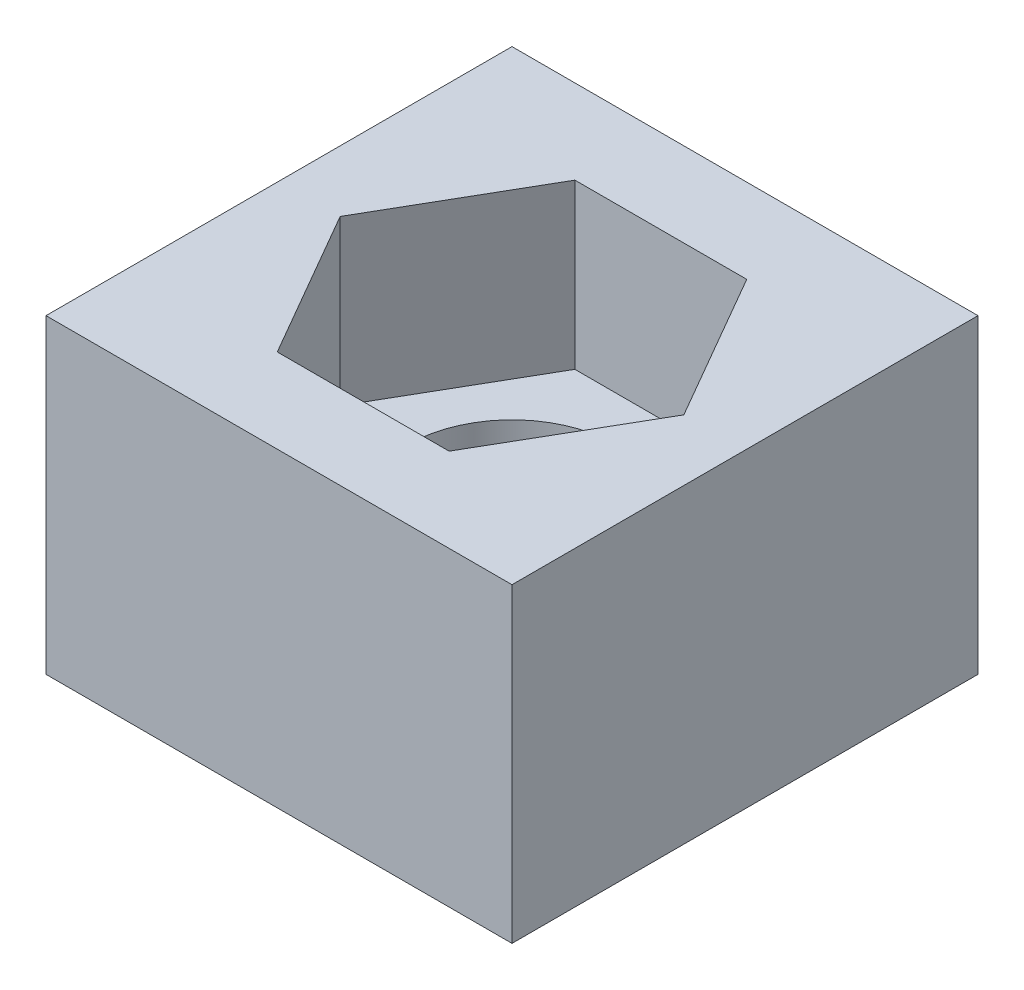
ISO-10303-21;
HEADER;
FILE_DESCRIPTION(('STEP AP214'),'2;1');
FILE_NAME('part.step','',(''),(''),'','','');
FILE_SCHEMA(('AUTOMOTIVE_DESIGN { 1 0 10303 214 1 1 1 1 }'));
ENDSEC;
DATA;
#1=APPLICATION_CONTEXT('core data for automotive mechanical design processes');
#2=APPLICATION_PROTOCOL_DEFINITION('international standard','automotive_design',2000,#1);
#3=PRODUCT_CONTEXT('',#1,'mechanical');
#4=PRODUCT('Part','Part','',(#3));
#5=PRODUCT_RELATED_PRODUCT_CATEGORY('part','',(#4));
#6=PRODUCT_DEFINITION_FORMATION('','',#4);
#7=PRODUCT_DEFINITION_CONTEXT('part definition',#1,'design');
#8=PRODUCT_DEFINITION('design','',#6,#7);
#9=PRODUCT_DEFINITION_SHAPE('','',#8);
#10=(LENGTH_UNIT() NAMED_UNIT(*) SI_UNIT(.MILLI.,.METRE.));
#11=(NAMED_UNIT(*) PLANE_ANGLE_UNIT() SI_UNIT($,.RADIAN.));
#12=(NAMED_UNIT(*) SI_UNIT($,.STERADIAN.) SOLID_ANGLE_UNIT());
#13=UNCERTAINTY_MEASURE_WITH_UNIT(LENGTH_MEASURE(1.E-05),#10,'distance_accuracy_value','');
#14=(GEOMETRIC_REPRESENTATION_CONTEXT(3) GLOBAL_UNCERTAINTY_ASSIGNED_CONTEXT((#13)) GLOBAL_UNIT_ASSIGNED_CONTEXT((#10,
#11,#12)) REPRESENTATION_CONTEXT('',''));
#15=CARTESIAN_POINT('',(0.,0.,0.));
#16=DIRECTION('',(0.,0.,1.));
#17=DIRECTION('',(1.,0.,0.));
#18=AXIS2_PLACEMENT_3D('',#15,#16,#17);
#19=CARTESIAN_POINT('',(0.,25.4,0.));
#20=DIRECTION('',(1.,0.,0.));
#21=DIRECTION('',(0.,0.,-1.));
#22=AXIS2_PLACEMENT_3D('',#19,#20,#21);
#23=PLANE('',#22);
#24=DIRECTION('',(0.,0.,1.));
#25=VECTOR('',#24,1.);
#26=CARTESIAN_POINT('',(0.,0.,0.));
#27=LINE('',#26,#25);
#28=CARTESIAN_POINT('',(0.,0.,-38.1018276824676));
#29=VERTEX_POINT('',#28);
#30=CARTESIAN_POINT('',(0.,0.,0.));
#31=VERTEX_POINT('',#30);
#32=EDGE_CURVE('E195',#29,#31,#27,.T.);
#33=ORIENTED_EDGE('',*,*,#32,.T.);
#34=DIRECTION('',(0.,-1.,0.));
#35=VECTOR('',#34,1.);
#36=CARTESIAN_POINT('',(0.,25.4,0.));
#37=LINE('',#36,#35);
#38=CARTESIAN_POINT('',(0.,25.4,0.));
#39=VERTEX_POINT('',#38);
#40=EDGE_CURVE('E11',#39,#31,#37,.T.);
#41=ORIENTED_EDGE('',*,*,#40,.F.);
#42=DIRECTION('',(0.,0.,1.));
#43=VECTOR('',#42,1.);
#44=CARTESIAN_POINT('',(0.,25.4,0.));
#45=LINE('',#44,#43);
#46=CARTESIAN_POINT('',(0.,25.4,-38.1018276824676));
#47=VERTEX_POINT('',#46);
#48=EDGE_CURVE('E207',#47,#39,#45,.T.);
#49=ORIENTED_EDGE('',*,*,#48,.F.);
#50=DIRECTION('',(0.,-1.,0.));
#51=VECTOR('',#50,1.);
#52=CARTESIAN_POINT('',(0.,25.4,-38.1018276824676));
#53=LINE('',#52,#51);
#54=EDGE_CURVE('E217',#47,#29,#53,.T.);
#55=ORIENTED_EDGE('',*,*,#54,.T.);
#56=EDGE_LOOP('',(#33,#41,#49,#55));
#57=FACE_BOUND('',#56,.T.);
#58=ADVANCED_FACE('F45',(#57),#23,.F.);
#59=CARTESIAN_POINT('',(0.,25.4,0.));
#60=DIRECTION('',(0.,0.,-1.));
#61=DIRECTION('',(-1.,0.,0.));
#62=AXIS2_PLACEMENT_3D('',#59,#60,#61);
#63=PLANE('',#62);
#64=DIRECTION('',(1.,0.,0.));
#65=VECTOR('',#64,1.);
#66=CARTESIAN_POINT('',(0.,0.,0.));
#67=LINE('',#66,#65);
#68=CARTESIAN_POINT('',(38.1018276824676,0.,0.));
#69=VERTEX_POINT('',#68);
#70=EDGE_CURVE('E221',#31,#69,#67,.T.);
#71=ORIENTED_EDGE('',*,*,#70,.T.);
#72=DIRECTION('',(0.,-1.,0.));
#73=VECTOR('',#72,1.);
#74=CARTESIAN_POINT('',(38.1018276824676,25.4,0.));
#75=LINE('',#74,#73);
#76=CARTESIAN_POINT('',(38.1018276824676,25.4,0.));
#77=VERTEX_POINT('',#76);
#78=EDGE_CURVE('E53',#77,#69,#75,.T.);
#79=ORIENTED_EDGE('',*,*,#78,.F.);
#80=DIRECTION('',(1.,0.,0.));
#81=VECTOR('',#80,1.);
#82=CARTESIAN_POINT('',(0.,25.4,0.));
#83=LINE('',#82,#81);
#84=EDGE_CURVE('E97',#39,#77,#83,.T.);
#85=ORIENTED_EDGE('',*,*,#84,.F.);
#86=ORIENTED_EDGE('',*,*,#40,.T.);
#87=EDGE_LOOP('',(#71,#79,#85,#86));
#88=FACE_BOUND('',#87,.T.);
#89=ADVANCED_FACE('F256',(#88),#63,.F.);
#90=CARTESIAN_POINT('',(38.1018276824676,25.4,0.));
#91=DIRECTION('',(-1.,0.,0.));
#92=DIRECTION('',(0.,0.,1.));
#93=AXIS2_PLACEMENT_3D('',#90,#91,#92);
#94=PLANE('',#93);
#95=DIRECTION('',(0.,0.,-1.));
#96=VECTOR('',#95,1.);
#97=CARTESIAN_POINT('',(38.1018276824676,0.,0.));
#98=LINE('',#97,#96);
#99=CARTESIAN_POINT('',(38.1018276824676,0.,-38.1018276824676));
#100=VERTEX_POINT('',#99);
#101=EDGE_CURVE('E224',#69,#100,#98,.T.);
#102=ORIENTED_EDGE('',*,*,#101,.T.);
#103=DIRECTION('',(0.,-1.,0.));
#104=VECTOR('',#103,1.);
#105=CARTESIAN_POINT('',(38.1018276824676,25.4,-38.1018276824676));
#106=LINE('',#105,#104);
#107=CARTESIAN_POINT('',(38.1018276824676,25.4,-38.1018276824676));
#108=VERTEX_POINT('',#107);
#109=EDGE_CURVE('E231',#108,#100,#106,.T.);
#110=ORIENTED_EDGE('',*,*,#109,.F.);
#111=DIRECTION('',(0.,0.,-1.));
#112=VECTOR('',#111,1.);
#113=CARTESIAN_POINT('',(38.1018276824676,25.4,0.));
#114=LINE('',#113,#112);
#115=EDGE_CURVE('E212',#77,#108,#114,.T.);
#116=ORIENTED_EDGE('',*,*,#115,.F.);
#117=ORIENTED_EDGE('',*,*,#78,.T.);
#118=EDGE_LOOP('',(#102,#110,#116,#117));
#119=FACE_BOUND('',#118,.T.);
#120=ADVANCED_FACE('F238',(#119),#94,.F.);
#121=CARTESIAN_POINT('',(0.,25.4,-38.1018276824676));
#122=DIRECTION('',(0.,0.,1.));
#123=DIRECTION('',(1.,0.,0.));
#124=AXIS2_PLACEMENT_3D('',#121,#122,#123);
#125=PLANE('',#124);
#126=DIRECTION('',(-1.,0.,0.));
#127=VECTOR('',#126,1.);
#128=CARTESIAN_POINT('',(0.,0.,-38.1018276824676));
#129=LINE('',#128,#127);
#130=EDGE_CURVE('E90',#100,#29,#129,.T.);
#131=ORIENTED_EDGE('',*,*,#130,.T.);
#132=ORIENTED_EDGE('',*,*,#54,.F.);
#133=DIRECTION('',(-1.,0.,0.));
#134=VECTOR('',#133,1.);
#135=CARTESIAN_POINT('',(0.,25.4,-38.1018276824676));
#136=LINE('',#135,#134);
#137=EDGE_CURVE('E69',#108,#47,#136,.T.);
#138=ORIENTED_EDGE('',*,*,#137,.F.);
#139=ORIENTED_EDGE('',*,*,#109,.T.);
#140=EDGE_LOOP('',(#131,#132,#138,#139));
#141=FACE_BOUND('',#140,.T.);
#142=ADVANCED_FACE('F246',(#141),#125,.F.);
#143=CARTESIAN_POINT('',(0.,25.4,0.));
#144=DIRECTION('',(0.,-1.,0.));
#145=DIRECTION('',(0.,0.,-1.));
#146=AXIS2_PLACEMENT_3D('',#143,#144,#145);
#147=PLANE('',#146);
#148=DIRECTION('',(-0.500000000000001,0.,-0.866025403784438));
#149=VECTOR('',#148,1.);
#150=CARTESIAN_POINT('',(33.1009128568949,25.4,-19.0509138412338));
#151=LINE('',#150,#149);
#152=CARTESIAN_POINT('',(33.1009128568949,25.4,-19.0509138412338));
#153=VERTEX_POINT('',#152);
#154=CARTESIAN_POINT('',(26.0759133490643,25.4,-31.2185699119426));
#155=VERTEX_POINT('',#154);
#156=EDGE_CURVE('E178',#153,#155,#151,.T.);
#157=ORIENTED_EDGE('',*,*,#156,.F.);
#158=DIRECTION('',(0.499999999999995,0.,-0.866025403784441));
#159=VECTOR('',#158,1.);
#160=CARTESIAN_POINT('',(26.0759133490645,25.4,-6.88325777052505));
#161=LINE('',#160,#159);
#162=CARTESIAN_POINT('',(26.0759133490645,25.4,-6.88325777052505));
#163=VERTEX_POINT('',#162);
#164=EDGE_CURVE('E60',#163,#153,#161,.T.);
#165=ORIENTED_EDGE('',*,*,#164,.F.);
#166=DIRECTION('',(1.,0.,0.));
#167=VECTOR('',#166,1.);
#168=CARTESIAN_POINT('',(12.0259143334034,25.4,-6.8832577705249));
#169=LINE('',#168,#167);
#170=CARTESIAN_POINT('',(12.0259143334034,25.4,-6.8832577705249));
#171=VERTEX_POINT('',#170);
#172=EDGE_CURVE('E155',#171,#163,#169,.T.);
#173=ORIENTED_EDGE('',*,*,#172,.F.);
#174=DIRECTION('',(0.500000000000007,0.,0.866025403784435));
#175=VECTOR('',#174,1.);
#176=CARTESIAN_POINT('',(5.00091482557274,25.4,-19.0509138412337));
#177=LINE('',#176,#175);
#178=CARTESIAN_POINT('',(5.00091482557274,25.4,-19.0509138412337));
#179=VERTEX_POINT('',#178);
#180=EDGE_CURVE('E159',#179,#171,#177,.T.);
#181=ORIENTED_EDGE('',*,*,#180,.F.);
#182=DIRECTION('',(-0.499999999999995,0.,0.866025403784441));
#183=VECTOR('',#182,1.);
#184=CARTESIAN_POINT('',(12.0259143334032,25.4,-31.2185699119426));
#185=LINE('',#184,#183);
#186=CARTESIAN_POINT('',(12.0259143334032,25.4,-31.2185699119426));
#187=VERTEX_POINT('',#186);
#188=EDGE_CURVE('E185',#187,#179,#185,.T.);
#189=ORIENTED_EDGE('',*,*,#188,.F.);
#190=DIRECTION('',(-1.,0.,0.));
#191=VECTOR('',#190,1.);
#192=CARTESIAN_POINT('',(26.0759133490643,25.4,-31.2185699119426));
#193=LINE('',#192,#191);
#194=EDGE_CURVE('E181',#155,#187,#193,.T.);
#195=ORIENTED_EDGE('',*,*,#194,.F.);
#196=EDGE_LOOP('',(#157,#165,#173,#181,#189,#195));
#197=FACE_BOUND('',#196,.T.);
#198=ORIENTED_EDGE('',*,*,#48,.T.);
#199=ORIENTED_EDGE('',*,*,#84,.T.);
#200=ORIENTED_EDGE('',*,*,#115,.T.);
#201=ORIENTED_EDGE('',*,*,#137,.T.);
#202=EDGE_LOOP('',(#198,#199,#200,#201));
#203=FACE_BOUND('',#202,.T.);
#204=ADVANCED_FACE('F248',(#197,#203),#147,.F.);
#205=CARTESIAN_POINT('',(0.,0.,0.));
#206=DIRECTION('',(0.,-1.,0.));
#207=DIRECTION('',(0.,0.,-1.));
#208=AXIS2_PLACEMENT_3D('',#205,#206,#207);
#209=PLANE('',#208);
#210=CARTESIAN_POINT('',(19.0509138412338,0.,-19.0509138412338));
#211=DIRECTION('',(0.,-1.,0.));
#212=DIRECTION('',(0.,0.,-1.));
#213=AXIS2_PLACEMENT_3D('',#210,#211,#212);
#214=CIRCLE('',#213,8.52304468357404);
#215=CARTESIAN_POINT('',(19.0509138412338,0.,-27.5739585248078));
#216=VERTEX_POINT('',#215);
#217=EDGE_CURVE('E370',#216,#216,#214,.T.);
#218=ORIENTED_EDGE('',*,*,#217,.F.);
#219=EDGE_LOOP('',(#218));
#220=FACE_BOUND('',#219,.T.);
#221=ORIENTED_EDGE('',*,*,#32,.F.);
#222=ORIENTED_EDGE('',*,*,#130,.F.);
#223=ORIENTED_EDGE('',*,*,#101,.F.);
#224=ORIENTED_EDGE('',*,*,#70,.F.);
#225=EDGE_LOOP('',(#221,#222,#223,#224));
#226=FACE_BOUND('',#225,.T.);
#227=ADVANCED_FACE('F242',(#220,#226),#209,.T.);
#228=CARTESIAN_POINT('',(26.0759133490645,12.,-6.88325777052505));
#229=DIRECTION('',(0.866025403784441,0.,0.499999999999995));
#230=DIRECTION('',(0.499999999999995,0.,-0.866025403784441));
#231=AXIS2_PLACEMENT_3D('',#228,#229,#230);
#232=PLANE('',#231);
#233=ORIENTED_EDGE('',*,*,#164,.T.);
#234=DIRECTION('',(0.,1.,0.));
#235=VECTOR('',#234,1.);
#236=CARTESIAN_POINT('',(33.1009128568949,12.,-19.0509138412338));
#237=LINE('',#236,#235);
#238=CARTESIAN_POINT('',(33.1009128568949,12.,-19.0509138412338));
#239=VERTEX_POINT('',#238);
#240=EDGE_CURVE('E129',#239,#153,#237,.T.);
#241=ORIENTED_EDGE('',*,*,#240,.F.);
#242=DIRECTION('',(0.499999999999995,0.,-0.866025403784441));
#243=VECTOR('',#242,1.);
#244=CARTESIAN_POINT('',(26.0759133490645,12.,-6.88325777052505));
#245=LINE('',#244,#243);
#246=CARTESIAN_POINT('',(26.0759133490645,12.,-6.88325777052505));
#247=VERTEX_POINT('',#246);
#248=EDGE_CURVE('E133',#247,#239,#245,.T.);
#249=ORIENTED_EDGE('',*,*,#248,.F.);
#250=DIRECTION('',(0.,1.,0.));
#251=VECTOR('',#250,1.);
#252=CARTESIAN_POINT('',(26.0759133490645,12.,-6.88325777052505));
#253=LINE('',#252,#251);
#254=EDGE_CURVE('E192',#247,#163,#253,.T.);
#255=ORIENTED_EDGE('',*,*,#254,.T.);
#256=EDGE_LOOP('',(#233,#241,#249,#255));
#257=FACE_BOUND('',#256,.T.);
#258=ADVANCED_FACE('F131',(#257),#232,.F.);
#259=CARTESIAN_POINT('',(12.0259143334034,12.,-6.8832577705249));
#260=DIRECTION('',(0.,0.,1.));
#261=DIRECTION('',(1.,0.,0.));
#262=AXIS2_PLACEMENT_3D('',#259,#260,#261);
#263=PLANE('',#262);
#264=ORIENTED_EDGE('',*,*,#172,.T.);
#265=ORIENTED_EDGE('',*,*,#254,.F.);
#266=DIRECTION('',(1.,0.,0.));
#267=VECTOR('',#266,1.);
#268=CARTESIAN_POINT('',(12.0259143334034,12.,-6.8832577705249));
#269=LINE('',#268,#267);
#270=CARTESIAN_POINT('',(12.0259143334034,12.,-6.8832577705249));
#271=VERTEX_POINT('',#270);
#272=EDGE_CURVE('E140',#271,#247,#269,.T.);
#273=ORIENTED_EDGE('',*,*,#272,.F.);
#274=DIRECTION('',(0.,1.,0.));
#275=VECTOR('',#274,1.);
#276=CARTESIAN_POINT('',(12.0259143334034,12.,-6.8832577705249));
#277=LINE('',#276,#275);
#278=EDGE_CURVE('E196',#271,#171,#277,.T.);
#279=ORIENTED_EDGE('',*,*,#278,.T.);
#280=EDGE_LOOP('',(#264,#265,#273,#279));
#281=FACE_BOUND('',#280,.T.);
#282=ADVANCED_FACE('F300',(#281),#263,.F.);
#283=CARTESIAN_POINT('',(5.00091482557274,12.,-19.0509138412337));
#284=DIRECTION('',(-0.866025403784435,0.,0.500000000000007));
#285=DIRECTION('',(0.500000000000007,0.,0.866025403784435));
#286=AXIS2_PLACEMENT_3D('',#283,#284,#285);
#287=PLANE('',#286);
#288=ORIENTED_EDGE('',*,*,#180,.T.);
#289=ORIENTED_EDGE('',*,*,#278,.F.);
#290=DIRECTION('',(0.500000000000007,0.,0.866025403784435));
#291=VECTOR('',#290,1.);
#292=CARTESIAN_POINT('',(5.00091482557274,12.,-19.0509138412337));
#293=LINE('',#292,#291);
#294=CARTESIAN_POINT('',(5.00091482557274,12.,-19.0509138412337));
#295=VERTEX_POINT('',#294);
#296=EDGE_CURVE('E171',#295,#271,#293,.T.);
#297=ORIENTED_EDGE('',*,*,#296,.F.);
#298=DIRECTION('',(0.,1.,0.));
#299=VECTOR('',#298,1.);
#300=CARTESIAN_POINT('',(5.00091482557274,12.,-19.0509138412337));
#301=LINE('',#300,#299);
#302=EDGE_CURVE('E199',#295,#179,#301,.T.);
#303=ORIENTED_EDGE('',*,*,#302,.T.);
#304=EDGE_LOOP('',(#288,#289,#297,#303));
#305=FACE_BOUND('',#304,.T.);
#306=ADVANCED_FACE('F309',(#305),#287,.F.);
#307=CARTESIAN_POINT('',(12.0259143334032,12.,-31.2185699119426));
#308=DIRECTION('',(-0.866025403784441,0.,-0.499999999999995));
#309=DIRECTION('',(-0.499999999999995,0.,0.866025403784442));
#310=AXIS2_PLACEMENT_3D('',#307,#308,#309);
#311=PLANE('',#310);
#312=ORIENTED_EDGE('',*,*,#188,.T.);
#313=ORIENTED_EDGE('',*,*,#302,.F.);
#314=DIRECTION('',(-0.499999999999995,0.,0.866025403784441));
#315=VECTOR('',#314,1.);
#316=CARTESIAN_POINT('',(12.0259143334032,12.,-31.2185699119426));
#317=LINE('',#316,#315);
#318=CARTESIAN_POINT('',(12.0259143334032,12.,-31.2185699119426));
#319=VERTEX_POINT('',#318);
#320=EDGE_CURVE('E167',#319,#295,#317,.T.);
#321=ORIENTED_EDGE('',*,*,#320,.F.);
#322=DIRECTION('',(0.,1.,0.));
#323=VECTOR('',#322,1.);
#324=CARTESIAN_POINT('',(12.0259143334032,12.,-31.2185699119426));
#325=LINE('',#324,#323);
#326=EDGE_CURVE('E202',#319,#187,#325,.T.);
#327=ORIENTED_EDGE('',*,*,#326,.T.);
#328=EDGE_LOOP('',(#312,#313,#321,#327));
#329=FACE_BOUND('',#328,.T.);
#330=ADVANCED_FACE('F319',(#329),#311,.F.);
#331=CARTESIAN_POINT('',(26.0759133490643,12.,-31.2185699119426));
#332=DIRECTION('',(0.,0.,-1.));
#333=DIRECTION('',(-1.,0.,0.));
#334=AXIS2_PLACEMENT_3D('',#331,#332,#333);
#335=PLANE('',#334);
#336=ORIENTED_EDGE('',*,*,#194,.T.);
#337=ORIENTED_EDGE('',*,*,#326,.F.);
#338=DIRECTION('',(-1.,0.,0.));
#339=VECTOR('',#338,1.);
#340=CARTESIAN_POINT('',(26.0759133490643,12.,-31.2185699119426));
#341=LINE('',#340,#339);
#342=CARTESIAN_POINT('',(26.0759133490643,12.,-31.2185699119426));
#343=VERTEX_POINT('',#342);
#344=EDGE_CURVE('E149',#343,#319,#341,.T.);
#345=ORIENTED_EDGE('',*,*,#344,.F.);
#346=DIRECTION('',(0.,1.,0.));
#347=VECTOR('',#346,1.);
#348=CARTESIAN_POINT('',(26.0759133490643,12.,-31.2185699119426));
#349=LINE('',#348,#347);
#350=EDGE_CURVE('E139',#343,#155,#349,.T.);
#351=ORIENTED_EDGE('',*,*,#350,.T.);
#352=EDGE_LOOP('',(#336,#337,#345,#351));
#353=FACE_BOUND('',#352,.T.);
#354=ADVANCED_FACE('F329',(#353),#335,.F.);
#355=CARTESIAN_POINT('',(33.1009128568949,12.,-19.0509138412338));
#356=DIRECTION('',(0.866025403784438,0.,-0.500000000000001));
#357=DIRECTION('',(-0.500000000000001,0.,-0.866025403784438));
#358=AXIS2_PLACEMENT_3D('',#355,#356,#357);
#359=PLANE('',#358);
#360=ORIENTED_EDGE('',*,*,#156,.T.);
#361=ORIENTED_EDGE('',*,*,#350,.F.);
#362=DIRECTION('',(-0.500000000000001,0.,-0.866025403784438));
#363=VECTOR('',#362,1.);
#364=CARTESIAN_POINT('',(33.1009128568949,12.,-19.0509138412338));
#365=LINE('',#364,#363);
#366=EDGE_CURVE('E143',#239,#343,#365,.T.);
#367=ORIENTED_EDGE('',*,*,#366,.F.);
#368=ORIENTED_EDGE('',*,*,#240,.T.);
#369=EDGE_LOOP('',(#360,#361,#367,#368));
#370=FACE_BOUND('',#369,.T.);
#371=ADVANCED_FACE('F144',(#370),#359,.F.);
#372=CARTESIAN_POINT('',(0.,12.,0.));
#373=DIRECTION('',(0.,1.,0.));
#374=DIRECTION('',(0.,0.,1.));
#375=AXIS2_PLACEMENT_3D('',#372,#373,#374);
#376=PLANE('',#375);
#377=CARTESIAN_POINT('',(19.0509138412338,12.,-19.0509138412338));
#378=DIRECTION('',(0.,1.,0.));
#379=DIRECTION('',(0.,0.,1.));
#380=AXIS2_PLACEMENT_3D('',#377,#378,#379);
#381=CIRCLE('',#380,8.52304468357404);
#382=CARTESIAN_POINT('',(19.0509138412338,12.,-10.5278691576598));
#383=VERTEX_POINT('',#382);
#384=EDGE_CURVE('E162',#383,#383,#381,.F.);
#385=ORIENTED_EDGE('',*,*,#384,.T.);
#386=EDGE_LOOP('',(#385));
#387=FACE_BOUND('',#386,.T.);
#388=ORIENTED_EDGE('',*,*,#248,.T.);
#389=ORIENTED_EDGE('',*,*,#366,.T.);
#390=ORIENTED_EDGE('',*,*,#344,.T.);
#391=ORIENTED_EDGE('',*,*,#320,.T.);
#392=ORIENTED_EDGE('',*,*,#296,.T.);
#393=ORIENTED_EDGE('',*,*,#272,.T.);
#394=EDGE_LOOP('',(#388,#389,#390,#391,#392,#393));
#395=FACE_BOUND('',#394,.T.);
#396=ADVANCED_FACE('F151',(#387,#395),#376,.T.);
#397=CARTESIAN_POINT('',(19.0509138412338,36.1068107684446,-19.0509138412338));
#398=DIRECTION('',(0.,-1.,0.));
#399=DIRECTION('',(0.,0.,-1.));
#400=AXIS2_PLACEMENT_3D('',#397,#398,#399);
#401=CYLINDRICAL_SURFACE('',#400,8.52304468357404);
#402=ORIENTED_EDGE('',*,*,#217,.T.);
#403=EDGE_LOOP('',(#402));
#404=FACE_BOUND('',#403,.T.);
#405=ORIENTED_EDGE('',*,*,#384,.F.);
#406=EDGE_LOOP('',(#405));
#407=FACE_BOUND('',#406,.T.);
#408=ADVANCED_FACE('F354',(#404,#407),#401,.F.);
#409=CLOSED_SHELL('',(#58,#89,#120,#142,#204,#227,#258,#282,#306,#330,#354,#371,#396,#408));
#410=MANIFOLD_SOLID_BREP('B2',#409);
#411=ADVANCED_BREP_SHAPE_REPRESENTATION('',(#18,#410),#14);
#412=SHAPE_DEFINITION_REPRESENTATION(#9,#411);
ENDSEC;
END-ISO-10303-21;
